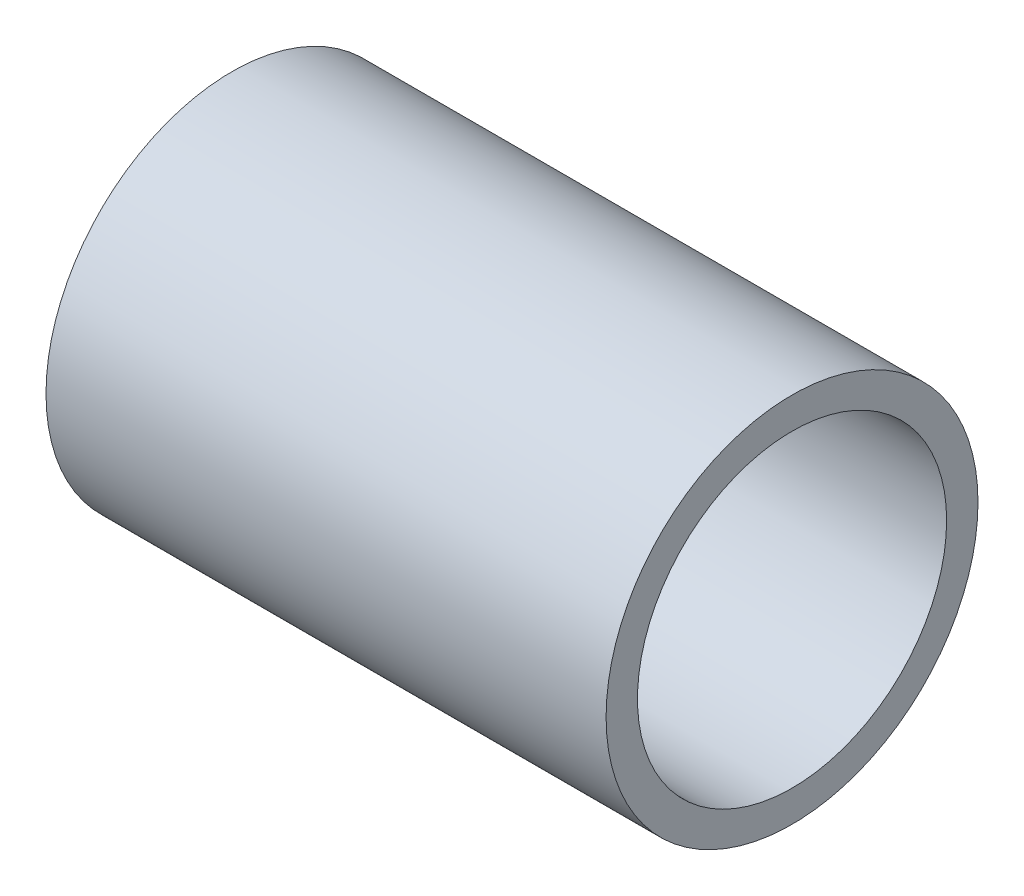
ISO-10303-21;
HEADER;
FILE_DESCRIPTION(('STEP AP214'),'2;1');
FILE_NAME('part.step','',(''),(''),'','','');
FILE_SCHEMA(('AUTOMOTIVE_DESIGN { 1 0 10303 214 1 1 1 1 }'));
ENDSEC;
DATA;
#1=APPLICATION_CONTEXT('core data for automotive mechanical design processes');
#2=APPLICATION_PROTOCOL_DEFINITION('international standard','automotive_design',2000,#1);
#3=PRODUCT_CONTEXT('',#1,'mechanical');
#4=PRODUCT('Part','Part','',(#3));
#5=PRODUCT_RELATED_PRODUCT_CATEGORY('part','',(#4));
#6=PRODUCT_DEFINITION_FORMATION('','',#4);
#7=PRODUCT_DEFINITION_CONTEXT('part definition',#1,'design');
#8=PRODUCT_DEFINITION('design','',#6,#7);
#9=PRODUCT_DEFINITION_SHAPE('','',#8);
#10=(LENGTH_UNIT() NAMED_UNIT(*) SI_UNIT(.MILLI.,.METRE.));
#11=(NAMED_UNIT(*) PLANE_ANGLE_UNIT() SI_UNIT($,.RADIAN.));
#12=(NAMED_UNIT(*) SI_UNIT($,.STERADIAN.) SOLID_ANGLE_UNIT());
#13=UNCERTAINTY_MEASURE_WITH_UNIT(LENGTH_MEASURE(1.E-05),#10,'distance_accuracy_value','');
#14=(GEOMETRIC_REPRESENTATION_CONTEXT(3) GLOBAL_UNCERTAINTY_ASSIGNED_CONTEXT((#13)) GLOBAL_UNIT_ASSIGNED_CONTEXT((#10,
#11,#12)) REPRESENTATION_CONTEXT('',''));
#15=CARTESIAN_POINT('',(0.,0.,0.));
#16=DIRECTION('',(0.,0.,1.));
#17=DIRECTION('',(1.,0.,0.));
#18=AXIS2_PLACEMENT_3D('',#15,#16,#17);
#19=CARTESIAN_POINT('',(-31.75,0.,0.));
#20=DIRECTION('',(1.,0.,0.));
#21=DIRECTION('',(0.,0.,-1.));
#22=AXIS2_PLACEMENT_3D('',#19,#20,#21);
#23=CYLINDRICAL_SURFACE('',#22,17.526);
#24=CARTESIAN_POINT('',(31.75,0.,0.));
#25=DIRECTION('',(1.,0.,0.));
#26=DIRECTION('',(0.,0.,-1.));
#27=AXIS2_PLACEMENT_3D('',#24,#25,#26);
#28=CIRCLE('',#27,17.526);
#29=CARTESIAN_POINT('',(31.75,0.,-17.526));
#30=VERTEX_POINT('',#29);
#31=EDGE_CURVE('E17',#30,#30,#28,.F.);
#32=ORIENTED_EDGE('',*,*,#31,.F.);
#33=EDGE_LOOP('',(#32));
#34=FACE_BOUND('',#33,.T.);
#35=CARTESIAN_POINT('',(-31.75,0.,0.));
#36=DIRECTION('',(1.,0.,0.));
#37=DIRECTION('',(0.,0.,-1.));
#38=AXIS2_PLACEMENT_3D('',#35,#36,#37);
#39=CIRCLE('',#38,17.526);
#40=CARTESIAN_POINT('',(-31.75,0.,-17.526));
#41=VERTEX_POINT('',#40);
#42=EDGE_CURVE('E26',#41,#41,#39,.F.);
#43=ORIENTED_EDGE('',*,*,#42,.T.);
#44=EDGE_LOOP('',(#43));
#45=FACE_BOUND('',#44,.T.);
#46=ADVANCED_FACE('F14',(#34,#45),#23,.F.);
#47=CARTESIAN_POINT('',(31.75,0.,0.));
#48=DIRECTION('',(1.,0.,0.));
#49=DIRECTION('',(0.,0.,-1.));
#50=AXIS2_PLACEMENT_3D('',#47,#48,#49);
#51=PLANE('',#50);
#52=ORIENTED_EDGE('',*,*,#31,.T.);
#53=EDGE_LOOP('',(#52));
#54=FACE_BOUND('',#53,.T.);
#55=CARTESIAN_POINT('',(31.75,0.,0.));
#56=DIRECTION('',(1.,0.,0.));
#57=DIRECTION('',(0.,0.,-1.));
#58=AXIS2_PLACEMENT_3D('',#55,#56,#57);
#59=CIRCLE('',#58,21.082);
#60=CARTESIAN_POINT('',(31.75,0.,-21.082));
#61=VERTEX_POINT('',#60);
#62=EDGE_CURVE('E21',#61,#61,#59,.F.);
#63=ORIENTED_EDGE('',*,*,#62,.F.);
#64=EDGE_LOOP('',(#63));
#65=FACE_BOUND('',#64,.T.);
#66=ADVANCED_FACE('F34',(#54,#65),#51,.T.);
#67=CARTESIAN_POINT('',(-31.75,0.,0.));
#68=DIRECTION('',(1.,0.,0.));
#69=DIRECTION('',(0.,0.,-1.));
#70=AXIS2_PLACEMENT_3D('',#67,#68,#69);
#71=PLANE('',#70);
#72=ORIENTED_EDGE('',*,*,#42,.F.);
#73=EDGE_LOOP('',(#72));
#74=FACE_BOUND('',#73,.T.);
#75=CARTESIAN_POINT('',(-31.75,0.,0.));
#76=DIRECTION('',(1.,0.,0.));
#77=DIRECTION('',(0.,0.,-1.));
#78=AXIS2_PLACEMENT_3D('',#75,#76,#77);
#79=CIRCLE('',#78,21.082);
#80=CARTESIAN_POINT('',(-31.75,0.,-21.082));
#81=VERTEX_POINT('',#80);
#82=EDGE_CURVE('E10',#81,#81,#79,.T.);
#83=ORIENTED_EDGE('',*,*,#82,.F.);
#84=EDGE_LOOP('',(#83));
#85=FACE_BOUND('',#84,.T.);
#86=ADVANCED_FACE('F42',(#74,#85),#71,.F.);
#87=CARTESIAN_POINT('',(-31.75,0.,0.));
#88=DIRECTION('',(1.,0.,0.));
#89=DIRECTION('',(0.,0.,-1.));
#90=AXIS2_PLACEMENT_3D('',#87,#88,#89);
#91=CYLINDRICAL_SURFACE('',#90,21.082);
#92=ORIENTED_EDGE('',*,*,#62,.T.);
#93=EDGE_LOOP('',(#92));
#94=FACE_BOUND('',#93,.T.);
#95=ORIENTED_EDGE('',*,*,#82,.T.);
#96=EDGE_LOOP('',(#95));
#97=FACE_BOUND('',#96,.T.);
#98=ADVANCED_FACE('F43',(#94,#97),#91,.T.);
#99=CLOSED_SHELL('',(#46,#66,#86,#98));
#100=MANIFOLD_SOLID_BREP('B1',#99);
#101=ADVANCED_BREP_SHAPE_REPRESENTATION('',(#18,#100),#14);
#102=SHAPE_DEFINITION_REPRESENTATION(#9,#101);
ENDSEC;
END-ISO-10303-21;
